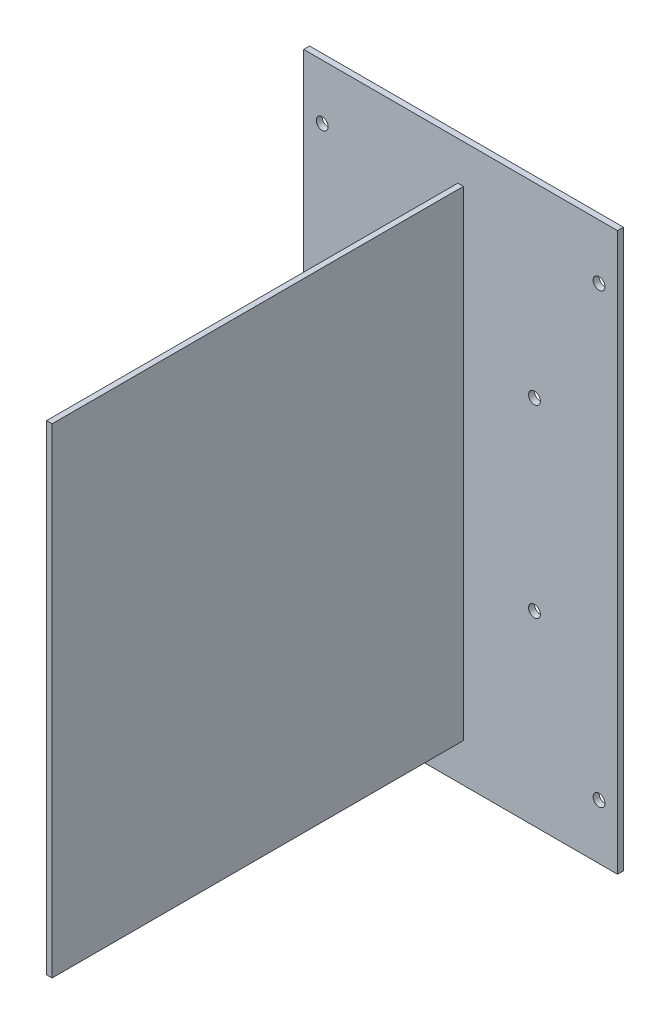
ISO-10303-21;
HEADER;
FILE_DESCRIPTION(('STEP AP214'),'2;1');
FILE_NAME('part.step','',(''),(''),'','','');
FILE_SCHEMA(('AUTOMOTIVE_DESIGN { 1 0 10303 214 1 1 1 1 }'));
ENDSEC;
DATA;
#1=APPLICATION_CONTEXT('core data for automotive mechanical design processes');
#2=APPLICATION_PROTOCOL_DEFINITION('international standard','automotive_design',2000,#1);
#3=PRODUCT_CONTEXT('',#1,'mechanical');
#4=PRODUCT('Part','Part','',(#3));
#5=PRODUCT_RELATED_PRODUCT_CATEGORY('part','',(#4));
#6=PRODUCT_DEFINITION_FORMATION('','',#4);
#7=PRODUCT_DEFINITION_CONTEXT('part definition',#1,'design');
#8=PRODUCT_DEFINITION('design','',#6,#7);
#9=PRODUCT_DEFINITION_SHAPE('','',#8);
#10=(LENGTH_UNIT() NAMED_UNIT(*) SI_UNIT(.MILLI.,.METRE.));
#11=(NAMED_UNIT(*) PLANE_ANGLE_UNIT() SI_UNIT($,.RADIAN.));
#12=(NAMED_UNIT(*) SI_UNIT($,.STERADIAN.) SOLID_ANGLE_UNIT());
#13=UNCERTAINTY_MEASURE_WITH_UNIT(LENGTH_MEASURE(1.E-05),#10,'distance_accuracy_value','');
#14=(GEOMETRIC_REPRESENTATION_CONTEXT(3) GLOBAL_UNCERTAINTY_ASSIGNED_CONTEXT((#13)) GLOBAL_UNIT_ASSIGNED_CONTEXT((#10,
#11,#12)) REPRESENTATION_CONTEXT('',''));
#15=CARTESIAN_POINT('',(0.,0.,0.));
#16=DIRECTION('',(0.,0.,1.));
#17=DIRECTION('',(1.,0.,0.));
#18=AXIS2_PLACEMENT_3D('',#15,#16,#17);
#19=CARTESIAN_POINT('',(-0.75,65.,113.));
#20=DIRECTION('',(-1.,0.,0.));
#21=DIRECTION('',(0.,0.,1.));
#22=AXIS2_PLACEMENT_3D('',#19,#20,#21);
#23=PLANE('',#22);
#24=DIRECTION('',(0.,1.,0.));
#25=VECTOR('',#24,1.);
#26=CARTESIAN_POINT('',(-0.75,65.,0.));
#27=LINE('',#26,#25);
#28=CARTESIAN_POINT('',(-0.75,-65.,0.));
#29=VERTEX_POINT('',#28);
#30=CARTESIAN_POINT('',(-0.75,65.,0.));
#31=VERTEX_POINT('',#30);
#32=EDGE_CURVE('E107',#29,#31,#27,.T.);
#33=ORIENTED_EDGE('',*,*,#32,.F.);
#34=DIRECTION('',(0.,0.,-1.));
#35=VECTOR('',#34,1.);
#36=CARTESIAN_POINT('',(-0.75,-65.,113.));
#37=LINE('',#36,#35);
#38=CARTESIAN_POINT('',(-0.75,-65.,113.));
#39=VERTEX_POINT('',#38);
#40=EDGE_CURVE('E12',#39,#29,#37,.T.);
#41=ORIENTED_EDGE('',*,*,#40,.F.);
#42=DIRECTION('',(0.,1.,0.));
#43=VECTOR('',#42,1.);
#44=CARTESIAN_POINT('',(-0.75,65.,113.));
#45=LINE('',#44,#43);
#46=CARTESIAN_POINT('',(-0.75,65.,113.));
#47=VERTEX_POINT('',#46);
#48=EDGE_CURVE('E101',#39,#47,#45,.T.);
#49=ORIENTED_EDGE('',*,*,#48,.T.);
#50=DIRECTION('',(0.,0.,-1.));
#51=VECTOR('',#50,1.);
#52=CARTESIAN_POINT('',(-0.75,65.,113.));
#53=LINE('',#52,#51);
#54=EDGE_CURVE('E46',#47,#31,#53,.T.);
#55=ORIENTED_EDGE('',*,*,#54,.T.);
#56=EDGE_LOOP('',(#33,#41,#49,#55));
#57=FACE_BOUND('',#56,.T.);
#58=ADVANCED_FACE('F43',(#57),#23,.T.);
#59=CARTESIAN_POINT('',(-0.75,-65.,113.));
#60=DIRECTION('',(0.,-1.,0.));
#61=DIRECTION('',(0.,0.,-1.));
#62=AXIS2_PLACEMENT_3D('',#59,#60,#61);
#63=PLANE('',#62);
#64=DIRECTION('',(-1.,0.,0.));
#65=VECTOR('',#64,1.);
#66=CARTESIAN_POINT('',(-0.75,-65.,0.));
#67=LINE('',#66,#65);
#68=CARTESIAN_POINT('',(0.75,-65.,0.));
#69=VERTEX_POINT('',#68);
#70=EDGE_CURVE('E103',#69,#29,#67,.T.);
#71=ORIENTED_EDGE('',*,*,#70,.F.);
#72=DIRECTION('',(0.,0.,-1.));
#73=VECTOR('',#72,1.);
#74=CARTESIAN_POINT('',(0.75,-65.,113.));
#75=LINE('',#74,#73);
#76=CARTESIAN_POINT('',(0.75,-65.,113.));
#77=VERTEX_POINT('',#76);
#78=EDGE_CURVE('E52',#77,#69,#75,.T.);
#79=ORIENTED_EDGE('',*,*,#78,.F.);
#80=DIRECTION('',(-1.,0.,0.));
#81=VECTOR('',#80,1.);
#82=CARTESIAN_POINT('',(-0.75,-65.,113.));
#83=LINE('',#82,#81);
#84=EDGE_CURVE('E98',#77,#39,#83,.T.);
#85=ORIENTED_EDGE('',*,*,#84,.T.);
#86=ORIENTED_EDGE('',*,*,#40,.T.);
#87=EDGE_LOOP('',(#71,#79,#85,#86));
#88=FACE_BOUND('',#87,.T.);
#89=ADVANCED_FACE('F117',(#88),#63,.T.);
#90=CARTESIAN_POINT('',(0.75,-65.,113.));
#91=DIRECTION('',(1.,0.,0.));
#92=DIRECTION('',(0.,1.,0.));
#93=AXIS2_PLACEMENT_3D('',#90,#91,#92);
#94=PLANE('',#93);
#95=DIRECTION('',(0.,-1.,0.));
#96=VECTOR('',#95,1.);
#97=CARTESIAN_POINT('',(0.75,-65.,0.));
#98=LINE('',#97,#96);
#99=CARTESIAN_POINT('',(0.75,65.,0.));
#100=VERTEX_POINT('',#99);
#101=EDGE_CURVE('E93',#100,#69,#98,.T.);
#102=ORIENTED_EDGE('',*,*,#101,.F.);
#103=DIRECTION('',(0.,0.,-1.));
#104=VECTOR('',#103,1.);
#105=CARTESIAN_POINT('',(0.75,65.,113.));
#106=LINE('',#105,#104);
#107=CARTESIAN_POINT('',(0.75,65.,113.));
#108=VERTEX_POINT('',#107);
#109=EDGE_CURVE('E88',#108,#100,#106,.T.);
#110=ORIENTED_EDGE('',*,*,#109,.F.);
#111=DIRECTION('',(0.,-1.,0.));
#112=VECTOR('',#111,1.);
#113=CARTESIAN_POINT('',(0.75,-65.,113.));
#114=LINE('',#113,#112);
#115=EDGE_CURVE('E91',#108,#77,#114,.T.);
#116=ORIENTED_EDGE('',*,*,#115,.T.);
#117=ORIENTED_EDGE('',*,*,#78,.T.);
#118=EDGE_LOOP('',(#102,#110,#116,#117));
#119=FACE_BOUND('',#118,.T.);
#120=ADVANCED_FACE('F90',(#119),#94,.T.);
#121=CARTESIAN_POINT('',(0.75,65.,113.));
#122=DIRECTION('',(0.,1.,0.));
#123=DIRECTION('',(0.,0.,1.));
#124=AXIS2_PLACEMENT_3D('',#121,#122,#123);
#125=PLANE('',#124);
#126=DIRECTION('',(1.,0.,0.));
#127=VECTOR('',#126,1.);
#128=CARTESIAN_POINT('',(0.75,65.,0.));
#129=LINE('',#128,#127);
#130=EDGE_CURVE('E110',#31,#100,#129,.T.);
#131=ORIENTED_EDGE('',*,*,#130,.F.);
#132=ORIENTED_EDGE('',*,*,#54,.F.);
#133=DIRECTION('',(1.,0.,0.));
#134=VECTOR('',#133,1.);
#135=CARTESIAN_POINT('',(0.75,65.,113.));
#136=LINE('',#135,#134);
#137=EDGE_CURVE('E97',#47,#108,#136,.T.);
#138=ORIENTED_EDGE('',*,*,#137,.T.);
#139=ORIENTED_EDGE('',*,*,#109,.T.);
#140=EDGE_LOOP('',(#131,#132,#138,#139));
#141=FACE_BOUND('',#140,.T.);
#142=ADVANCED_FACE('F100',(#141),#125,.T.);
#143=CARTESIAN_POINT('',(0.,0.,113.));
#144=DIRECTION('',(0.,0.,1.));
#145=DIRECTION('',(1.,0.,0.));
#146=AXIS2_PLACEMENT_3D('',#143,#144,#145);
#147=PLANE('',#146);
#148=ORIENTED_EDGE('',*,*,#48,.F.);
#149=ORIENTED_EDGE('',*,*,#84,.F.);
#150=ORIENTED_EDGE('',*,*,#115,.F.);
#151=ORIENTED_EDGE('',*,*,#137,.F.);
#152=EDGE_LOOP('',(#148,#149,#150,#151));
#153=FACE_BOUND('',#152,.T.);
#154=ADVANCED_FACE('F96',(#153),#147,.T.);
#155=CARTESIAN_POINT('',(0.,0.,0.));
#156=DIRECTION('',(0.,0.,1.));
#157=DIRECTION('',(1.,0.,0.));
#158=AXIS2_PLACEMENT_3D('',#155,#156,#157);
#159=PLANE('',#158);
#160=ORIENTED_EDGE('',*,*,#32,.T.);
#161=ORIENTED_EDGE('',*,*,#130,.T.);
#162=ORIENTED_EDGE('',*,*,#101,.T.);
#163=ORIENTED_EDGE('',*,*,#70,.T.);
#164=EDGE_LOOP('',(#160,#161,#162,#163));
#165=FACE_BOUND('',#164,.T.);
#166=ADVANCED_FACE('F116',(#165),#159,.F.);
#167=CLOSED_SHELL('',(#58,#89,#120,#142,#154,#166));
#168=MANIFOLD_SOLID_BREP('B2',#167);
#169=CARTESIAN_POINT('',(0.,0.,1.6));
#170=DIRECTION('',(0.,0.,-1.));
#171=DIRECTION('',(-1.,0.,0.));
#172=AXIS2_PLACEMENT_3D('',#169,#170,#171);
#173=PLANE('',#172);
#174=DIRECTION('',(1.,0.,0.));
#175=VECTOR('',#174,1.);
#176=CARTESIAN_POINT('',(0.75,-65.,1.6));
#177=LINE('',#176,#175);
#178=CARTESIAN_POINT('',(-0.75,-65.,1.6));
#179=VERTEX_POINT('',#178);
#180=CARTESIAN_POINT('',(0.75,-65.,1.6));
#181=VERTEX_POINT('',#180);
#182=EDGE_CURVE('E259',#179,#181,#177,.T.);
#183=ORIENTED_EDGE('',*,*,#182,.F.);
#184=DIRECTION('',(0.,-1.,0.));
#185=VECTOR('',#184,1.);
#186=CARTESIAN_POINT('',(-0.75,-65.,1.6));
#187=LINE('',#186,#185);
#188=CARTESIAN_POINT('',(-0.75,65.,1.6));
#189=VERTEX_POINT('',#188);
#190=EDGE_CURVE('E182',#189,#179,#187,.T.);
#191=ORIENTED_EDGE('',*,*,#190,.F.);
#192=DIRECTION('',(-1.,0.,0.));
#193=VECTOR('',#192,1.);
#194=CARTESIAN_POINT('',(0.75,65.,1.6));
#195=LINE('',#194,#193);
#196=CARTESIAN_POINT('',(0.75,65.,1.6));
#197=VERTEX_POINT('',#196);
#198=EDGE_CURVE('E250',#197,#189,#195,.T.);
#199=ORIENTED_EDGE('',*,*,#198,.F.);
#200=DIRECTION('',(0.,1.,0.));
#201=VECTOR('',#200,1.);
#202=CARTESIAN_POINT('',(0.75,-65.,1.6));
#203=LINE('',#202,#201);
#204=EDGE_CURVE('E253',#181,#197,#203,.T.);
#205=ORIENTED_EDGE('',*,*,#204,.F.);
#206=EDGE_LOOP('',(#183,#191,#199,#205));
#207=FACE_BOUND('',#206,.T.);
#208=DIRECTION('',(0.,-1.,0.));
#209=VECTOR('',#208,1.);
#210=CARTESIAN_POINT('',(-42.5,75.5,1.6));
#211=LINE('',#210,#209);
#212=CARTESIAN_POINT('',(-42.5,75.5,1.6));
#213=VERTEX_POINT('',#212);
#214=CARTESIAN_POINT('',(-42.5,-75.5,1.6));
#215=VERTEX_POINT('',#214);
#216=EDGE_CURVE('E317',#213,#215,#211,.T.);
#217=ORIENTED_EDGE('',*,*,#216,.T.);
#218=DIRECTION('',(1.,0.,0.));
#219=VECTOR('',#218,1.);
#220=CARTESIAN_POINT('',(42.5,-75.5,1.6));
#221=LINE('',#220,#219);
#222=CARTESIAN_POINT('',(42.5,-75.5,1.6));
#223=VERTEX_POINT('',#222);
#224=EDGE_CURVE('E320',#215,#223,#221,.T.);
#225=ORIENTED_EDGE('',*,*,#224,.T.);
#226=DIRECTION('',(0.,1.,0.));
#227=VECTOR('',#226,1.);
#228=CARTESIAN_POINT('',(42.5,75.5,1.6));
#229=LINE('',#228,#227);
#230=CARTESIAN_POINT('',(42.5,75.5,1.6));
#231=VERTEX_POINT('',#230);
#232=EDGE_CURVE('E323',#223,#231,#229,.T.);
#233=ORIENTED_EDGE('',*,*,#232,.T.);
#234=DIRECTION('',(-1.,0.,0.));
#235=VECTOR('',#234,1.);
#236=CARTESIAN_POINT('',(42.5,75.5,1.6));
#237=LINE('',#236,#235);
#238=EDGE_CURVE('E325',#231,#213,#237,.T.);
#239=ORIENTED_EDGE('',*,*,#238,.T.);
#240=EDGE_LOOP('',(#217,#225,#233,#239));
#241=FACE_BOUND('',#240,.T.);
#242=CARTESIAN_POINT('',(37.5,60.6,1.6));
#243=DIRECTION('',(0.,0.,1.));
#244=DIRECTION('',(1.,0.,0.));
#245=AXIS2_PLACEMENT_3D('',#242,#243,#244);
#246=CIRCLE('',#245,1.6);
#247=CARTESIAN_POINT('',(39.1,60.6,1.6));
#248=VERTEX_POINT('',#247);
#249=EDGE_CURVE('E311',#248,#248,#246,.T.);
#250=ORIENTED_EDGE('',*,*,#249,.F.);
#251=EDGE_LOOP('',(#250));
#252=FACE_BOUND('',#251,.T.);
#253=CARTESIAN_POINT('',(-37.5,60.6,1.6));
#254=DIRECTION('',(0.,0.,1.));
#255=DIRECTION('',(1.,0.,0.));
#256=AXIS2_PLACEMENT_3D('',#253,#254,#255);
#257=CIRCLE('',#256,1.6);
#258=CARTESIAN_POINT('',(-35.9,60.6,1.6));
#259=VERTEX_POINT('',#258);
#260=EDGE_CURVE('E305',#259,#259,#257,.T.);
#261=ORIENTED_EDGE('',*,*,#260,.F.);
#262=EDGE_LOOP('',(#261));
#263=FACE_BOUND('',#262,.T.);
#264=CARTESIAN_POINT('',(-37.5,-60.6,1.6));
#265=DIRECTION('',(0.,0.,1.));
#266=DIRECTION('',(1.,0.,0.));
#267=AXIS2_PLACEMENT_3D('',#264,#265,#266);
#268=CIRCLE('',#267,1.6);
#269=CARTESIAN_POINT('',(-35.9,-60.6,1.6));
#270=VERTEX_POINT('',#269);
#271=EDGE_CURVE('E299',#270,#270,#268,.T.);
#272=ORIENTED_EDGE('',*,*,#271,.F.);
#273=EDGE_LOOP('',(#272));
#274=FACE_BOUND('',#273,.T.);
#275=CARTESIAN_POINT('',(37.5,-60.6,1.6));
#276=DIRECTION('',(0.,0.,1.));
#277=DIRECTION('',(1.,0.,0.));
#278=AXIS2_PLACEMENT_3D('',#275,#276,#277);
#279=CIRCLE('',#278,1.6);
#280=CARTESIAN_POINT('',(39.1,-60.6,1.6));
#281=VERTEX_POINT('',#280);
#282=EDGE_CURVE('E293',#281,#281,#279,.T.);
#283=ORIENTED_EDGE('',*,*,#282,.F.);
#284=EDGE_LOOP('',(#283));
#285=FACE_BOUND('',#284,.T.);
#286=CARTESIAN_POINT('',(-20.,25.,1.6));
#287=DIRECTION('',(0.,0.,1.));
#288=DIRECTION('',(1.,0.,0.));
#289=AXIS2_PLACEMENT_3D('',#286,#287,#288);
#290=CIRCLE('',#289,1.6);
#291=CARTESIAN_POINT('',(-18.4,25.,1.6));
#292=VERTEX_POINT('',#291);
#293=EDGE_CURVE('E287',#292,#292,#290,.T.);
#294=ORIENTED_EDGE('',*,*,#293,.F.);
#295=EDGE_LOOP('',(#294));
#296=FACE_BOUND('',#295,.T.);
#297=CARTESIAN_POINT('',(20.,25.,1.6));
#298=DIRECTION('',(0.,0.,1.));
#299=DIRECTION('',(1.,0.,0.));
#300=AXIS2_PLACEMENT_3D('',#297,#298,#299);
#301=CIRCLE('',#300,1.6);
#302=CARTESIAN_POINT('',(21.6,25.,1.6));
#303=VERTEX_POINT('',#302);
#304=EDGE_CURVE('E281',#303,#303,#301,.T.);
#305=ORIENTED_EDGE('',*,*,#304,.F.);
#306=EDGE_LOOP('',(#305));
#307=FACE_BOUND('',#306,.T.);
#308=CARTESIAN_POINT('',(20.,-25.,1.6));
#309=DIRECTION('',(0.,0.,1.));
#310=DIRECTION('',(1.,0.,0.));
#311=AXIS2_PLACEMENT_3D('',#308,#309,#310);
#312=CIRCLE('',#311,1.6);
#313=CARTESIAN_POINT('',(21.6,-25.,1.6));
#314=VERTEX_POINT('',#313);
#315=EDGE_CURVE('E275',#314,#314,#312,.T.);
#316=ORIENTED_EDGE('',*,*,#315,.F.);
#317=EDGE_LOOP('',(#316));
#318=FACE_BOUND('',#317,.T.);
#319=CARTESIAN_POINT('',(-20.,-25.,1.6));
#320=DIRECTION('',(0.,0.,1.));
#321=DIRECTION('',(1.,0.,0.));
#322=AXIS2_PLACEMENT_3D('',#319,#320,#321);
#323=CIRCLE('',#322,1.6);
#324=CARTESIAN_POINT('',(-18.4,-25.,1.6));
#325=VERTEX_POINT('',#324);
#326=EDGE_CURVE('E269',#325,#325,#323,.T.);
#327=ORIENTED_EDGE('',*,*,#326,.F.);
#328=EDGE_LOOP('',(#327));
#329=FACE_BOUND('',#328,.T.);
#330=ADVANCED_FACE('F167',(#207,#241,#252,#263,#274,#285,#296,#307,#318,#329),#173,.F.);
#331=CARTESIAN_POINT('',(0.,0.,0.));
#332=DIRECTION('',(0.,0.,-1.));
#333=DIRECTION('',(-1.,0.,0.));
#334=AXIS2_PLACEMENT_3D('',#331,#332,#333);
#335=PLANE('',#334);
#336=DIRECTION('',(0.,-1.,0.));
#337=VECTOR('',#336,1.);
#338=CARTESIAN_POINT('',(-0.75,-65.,0.));
#339=LINE('',#338,#337);
#340=CARTESIAN_POINT('',(-0.75,65.,0.));
#341=VERTEX_POINT('',#340);
#342=CARTESIAN_POINT('',(-0.75,-65.,0.));
#343=VERTEX_POINT('',#342);
#344=EDGE_CURVE('E234',#341,#343,#339,.T.);
#345=ORIENTED_EDGE('',*,*,#344,.T.);
#346=DIRECTION('',(1.,0.,0.));
#347=VECTOR('',#346,1.);
#348=CARTESIAN_POINT('',(0.75,-65.,0.));
#349=LINE('',#348,#347);
#350=CARTESIAN_POINT('',(0.75,-65.,0.));
#351=VERTEX_POINT('',#350);
#352=EDGE_CURVE('E243',#343,#351,#349,.T.);
#353=ORIENTED_EDGE('',*,*,#352,.T.);
#354=DIRECTION('',(0.,1.,0.));
#355=VECTOR('',#354,1.);
#356=CARTESIAN_POINT('',(0.75,-65.,0.));
#357=LINE('',#356,#355);
#358=CARTESIAN_POINT('',(0.75,65.,0.));
#359=VERTEX_POINT('',#358);
#360=EDGE_CURVE('E190',#351,#359,#357,.T.);
#361=ORIENTED_EDGE('',*,*,#360,.T.);
#362=DIRECTION('',(-1.,0.,0.));
#363=VECTOR('',#362,1.);
#364=CARTESIAN_POINT('',(0.75,65.,0.));
#365=LINE('',#364,#363);
#366=EDGE_CURVE('E240',#359,#341,#365,.T.);
#367=ORIENTED_EDGE('',*,*,#366,.T.);
#368=EDGE_LOOP('',(#345,#353,#361,#367));
#369=FACE_BOUND('',#368,.T.);
#370=CARTESIAN_POINT('',(20.,-25.,0.));
#371=DIRECTION('',(0.,0.,1.));
#372=DIRECTION('',(1.,0.,0.));
#373=AXIS2_PLACEMENT_3D('',#370,#371,#372);
#374=CIRCLE('',#373,1.6);
#375=CARTESIAN_POINT('',(21.6,-25.,0.));
#376=VERTEX_POINT('',#375);
#377=EDGE_CURVE('E272',#376,#376,#374,.T.);
#378=ORIENTED_EDGE('',*,*,#377,.T.);
#379=EDGE_LOOP('',(#378));
#380=FACE_BOUND('',#379,.T.);
#381=CARTESIAN_POINT('',(-20.,25.,0.));
#382=DIRECTION('',(0.,0.,1.));
#383=DIRECTION('',(1.,0.,0.));
#384=AXIS2_PLACEMENT_3D('',#381,#382,#383);
#385=CIRCLE('',#384,1.6);
#386=CARTESIAN_POINT('',(-18.4,25.,0.));
#387=VERTEX_POINT('',#386);
#388=EDGE_CURVE('E284',#387,#387,#385,.T.);
#389=ORIENTED_EDGE('',*,*,#388,.T.);
#390=EDGE_LOOP('',(#389));
#391=FACE_BOUND('',#390,.T.);
#392=CARTESIAN_POINT('',(-37.5,-60.6,0.));
#393=DIRECTION('',(0.,0.,1.));
#394=DIRECTION('',(1.,0.,0.));
#395=AXIS2_PLACEMENT_3D('',#392,#393,#394);
#396=CIRCLE('',#395,1.6);
#397=CARTESIAN_POINT('',(-35.9,-60.6,0.));
#398=VERTEX_POINT('',#397);
#399=EDGE_CURVE('E296',#398,#398,#396,.T.);
#400=ORIENTED_EDGE('',*,*,#399,.T.);
#401=EDGE_LOOP('',(#400));
#402=FACE_BOUND('',#401,.T.);
#403=CARTESIAN_POINT('',(37.5,60.6,0.));
#404=DIRECTION('',(0.,0.,1.));
#405=DIRECTION('',(1.,0.,0.));
#406=AXIS2_PLACEMENT_3D('',#403,#404,#405);
#407=CIRCLE('',#406,1.6);
#408=CARTESIAN_POINT('',(39.1,60.6,0.));
#409=VERTEX_POINT('',#408);
#410=EDGE_CURVE('E308',#409,#409,#407,.T.);
#411=ORIENTED_EDGE('',*,*,#410,.T.);
#412=EDGE_LOOP('',(#411));
#413=FACE_BOUND('',#412,.T.);
#414=DIRECTION('',(0.,-1.,0.));
#415=VECTOR('',#414,1.);
#416=CARTESIAN_POINT('',(-42.5,75.5,0.));
#417=LINE('',#416,#415);
#418=CARTESIAN_POINT('',(-42.5,75.5,0.));
#419=VERTEX_POINT('',#418);
#420=CARTESIAN_POINT('',(-42.5,-75.5,0.));
#421=VERTEX_POINT('',#420);
#422=EDGE_CURVE('E314',#419,#421,#417,.T.);
#423=ORIENTED_EDGE('',*,*,#422,.F.);
#424=DIRECTION('',(-1.,0.,0.));
#425=VECTOR('',#424,1.);
#426=CARTESIAN_POINT('',(42.5,75.5,0.));
#427=LINE('',#426,#425);
#428=CARTESIAN_POINT('',(42.5,75.5,0.));
#429=VERTEX_POINT('',#428);
#430=EDGE_CURVE('E321',#429,#419,#427,.T.);
#431=ORIENTED_EDGE('',*,*,#430,.F.);
#432=DIRECTION('',(0.,1.,0.));
#433=VECTOR('',#432,1.);
#434=CARTESIAN_POINT('',(42.5,75.5,0.));
#435=LINE('',#434,#433);
#436=CARTESIAN_POINT('',(42.5,-75.5,0.));
#437=VERTEX_POINT('',#436);
#438=EDGE_CURVE('E332',#437,#429,#435,.T.);
#439=ORIENTED_EDGE('',*,*,#438,.F.);
#440=DIRECTION('',(1.,0.,0.));
#441=VECTOR('',#440,1.);
#442=CARTESIAN_POINT('',(42.5,-75.5,0.));
#443=LINE('',#442,#441);
#444=EDGE_CURVE('E330',#421,#437,#443,.T.);
#445=ORIENTED_EDGE('',*,*,#444,.F.);
#446=EDGE_LOOP('',(#423,#431,#439,#445));
#447=FACE_BOUND('',#446,.T.);
#448=CARTESIAN_POINT('',(-37.5,60.6,0.));
#449=DIRECTION('',(0.,0.,1.));
#450=DIRECTION('',(1.,0.,0.));
#451=AXIS2_PLACEMENT_3D('',#448,#449,#450);
#452=CIRCLE('',#451,1.6);
#453=CARTESIAN_POINT('',(-35.9,60.6,0.));
#454=VERTEX_POINT('',#453);
#455=EDGE_CURVE('E302',#454,#454,#452,.T.);
#456=ORIENTED_EDGE('',*,*,#455,.T.);
#457=EDGE_LOOP('',(#456));
#458=FACE_BOUND('',#457,.T.);
#459=CARTESIAN_POINT('',(37.5,-60.6,0.));
#460=DIRECTION('',(0.,0.,1.));
#461=DIRECTION('',(1.,0.,0.));
#462=AXIS2_PLACEMENT_3D('',#459,#460,#461);
#463=CIRCLE('',#462,1.6);
#464=CARTESIAN_POINT('',(39.1,-60.6,0.));
#465=VERTEX_POINT('',#464);
#466=EDGE_CURVE('E290',#465,#465,#463,.T.);
#467=ORIENTED_EDGE('',*,*,#466,.T.);
#468=EDGE_LOOP('',(#467));
#469=FACE_BOUND('',#468,.T.);
#470=CARTESIAN_POINT('',(20.,25.,0.));
#471=DIRECTION('',(0.,0.,1.));
#472=DIRECTION('',(1.,0.,0.));
#473=AXIS2_PLACEMENT_3D('',#470,#471,#472);
#474=CIRCLE('',#473,1.6);
#475=CARTESIAN_POINT('',(21.6,25.,0.));
#476=VERTEX_POINT('',#475);
#477=EDGE_CURVE('E278',#476,#476,#474,.T.);
#478=ORIENTED_EDGE('',*,*,#477,.T.);
#479=EDGE_LOOP('',(#478));
#480=FACE_BOUND('',#479,.T.);
#481=CARTESIAN_POINT('',(-20.,-25.,0.));
#482=DIRECTION('',(0.,0.,1.));
#483=DIRECTION('',(1.,0.,0.));
#484=AXIS2_PLACEMENT_3D('',#481,#482,#483);
#485=CIRCLE('',#484,1.6);
#486=CARTESIAN_POINT('',(-18.4,-25.,0.));
#487=VERTEX_POINT('',#486);
#488=EDGE_CURVE('E265',#487,#487,#485,.T.);
#489=ORIENTED_EDGE('',*,*,#488,.T.);
#490=EDGE_LOOP('',(#489));
#491=FACE_BOUND('',#490,.T.);
#492=ADVANCED_FACE('F247',(#369,#380,#391,#402,#413,#447,#458,#469,#480,#491),#335,.T.);
#493=CARTESIAN_POINT('',(-42.5,75.5,1.6));
#494=DIRECTION('',(1.,0.,0.));
#495=DIRECTION('',(0.,1.,0.));
#496=AXIS2_PLACEMENT_3D('',#493,#494,#495);
#497=PLANE('',#496);
#498=ORIENTED_EDGE('',*,*,#422,.T.);
#499=DIRECTION('',(0.,0.,-1.));
#500=VECTOR('',#499,1.);
#501=CARTESIAN_POINT('',(-42.5,-75.5,1.6));
#502=LINE('',#501,#500);
#503=EDGE_CURVE('E41',#215,#421,#502,.T.);
#504=ORIENTED_EDGE('',*,*,#503,.F.);
#505=ORIENTED_EDGE('',*,*,#216,.F.);
#506=DIRECTION('',(0.,0.,-1.));
#507=VECTOR('',#506,1.);
#508=CARTESIAN_POINT('',(-42.5,75.5,1.6));
#509=LINE('',#508,#507);
#510=EDGE_CURVE('E327',#213,#419,#509,.T.);
#511=ORIENTED_EDGE('',*,*,#510,.T.);
#512=EDGE_LOOP('',(#498,#504,#505,#511));
#513=FACE_BOUND('',#512,.T.);
#514=ADVANCED_FACE('F169',(#513),#497,.F.);
#515=CARTESIAN_POINT('',(42.5,-75.5,1.6));
#516=DIRECTION('',(0.,1.,0.));
#517=DIRECTION('',(-1.,0.,0.));
#518=AXIS2_PLACEMENT_3D('',#515,#516,#517);
#519=PLANE('',#518);
#520=ORIENTED_EDGE('',*,*,#444,.T.);
#521=DIRECTION('',(0.,0.,-1.));
#522=VECTOR('',#521,1.);
#523=CARTESIAN_POINT('',(42.5,-75.5,1.6));
#524=LINE('',#523,#522);
#525=EDGE_CURVE('E175',#223,#437,#524,.T.);
#526=ORIENTED_EDGE('',*,*,#525,.F.);
#527=ORIENTED_EDGE('',*,*,#224,.F.);
#528=ORIENTED_EDGE('',*,*,#503,.T.);
#529=EDGE_LOOP('',(#520,#526,#527,#528));
#530=FACE_BOUND('',#529,.T.);
#531=ADVANCED_FACE('F360',(#530),#519,.F.);
#532=CARTESIAN_POINT('',(42.5,75.5,1.6));
#533=DIRECTION('',(-1.,0.,0.));
#534=DIRECTION('',(0.,-1.,0.));
#535=AXIS2_PLACEMENT_3D('',#532,#533,#534);
#536=PLANE('',#535);
#537=ORIENTED_EDGE('',*,*,#438,.T.);
#538=DIRECTION('',(0.,0.,-1.));
#539=VECTOR('',#538,1.);
#540=CARTESIAN_POINT('',(42.5,75.5,1.6));
#541=LINE('',#540,#539);
#542=EDGE_CURVE('E337',#231,#429,#541,.T.);
#543=ORIENTED_EDGE('',*,*,#542,.F.);
#544=ORIENTED_EDGE('',*,*,#232,.F.);
#545=ORIENTED_EDGE('',*,*,#525,.T.);
#546=EDGE_LOOP('',(#537,#543,#544,#545));
#547=FACE_BOUND('',#546,.T.);
#548=ADVANCED_FACE('F344',(#547),#536,.F.);
#549=CARTESIAN_POINT('',(42.5,75.5,1.6));
#550=DIRECTION('',(0.,-1.,0.));
#551=DIRECTION('',(0.,0.,-1.));
#552=AXIS2_PLACEMENT_3D('',#549,#550,#551);
#553=PLANE('',#552);
#554=ORIENTED_EDGE('',*,*,#430,.T.);
#555=ORIENTED_EDGE('',*,*,#510,.F.);
#556=ORIENTED_EDGE('',*,*,#238,.F.);
#557=ORIENTED_EDGE('',*,*,#542,.T.);
#558=EDGE_LOOP('',(#554,#555,#556,#557));
#559=FACE_BOUND('',#558,.T.);
#560=ADVANCED_FACE('F353',(#559),#553,.F.);
#561=CARTESIAN_POINT('',(37.5,60.6,1.6));
#562=DIRECTION('',(0.,0.,-1.));
#563=DIRECTION('',(-1.,0.,0.));
#564=AXIS2_PLACEMENT_3D('',#561,#562,#563);
#565=CYLINDRICAL_SURFACE('',#564,1.6);
#566=ORIENTED_EDGE('',*,*,#249,.T.);
#567=EDGE_LOOP('',(#566));
#568=FACE_BOUND('',#567,.T.);
#569=ORIENTED_EDGE('',*,*,#410,.F.);
#570=EDGE_LOOP('',(#569));
#571=FACE_BOUND('',#570,.T.);
#572=ADVANCED_FACE('F375',(#568,#571),#565,.F.);
#573=CARTESIAN_POINT('',(-37.5,60.6,1.6));
#574=DIRECTION('',(0.,0.,-1.));
#575=DIRECTION('',(-1.,0.,0.));
#576=AXIS2_PLACEMENT_3D('',#573,#574,#575);
#577=CYLINDRICAL_SURFACE('',#576,1.6);
#578=ORIENTED_EDGE('',*,*,#260,.T.);
#579=EDGE_LOOP('',(#578));
#580=FACE_BOUND('',#579,.T.);
#581=ORIENTED_EDGE('',*,*,#455,.F.);
#582=EDGE_LOOP('',(#581));
#583=FACE_BOUND('',#582,.T.);
#584=ADVANCED_FACE('F382',(#580,#583),#577,.F.);
#585=CARTESIAN_POINT('',(-37.5,-60.6,1.6));
#586=DIRECTION('',(0.,0.,-1.));
#587=DIRECTION('',(-1.,0.,0.));
#588=AXIS2_PLACEMENT_3D('',#585,#586,#587);
#589=CYLINDRICAL_SURFACE('',#588,1.6);
#590=ORIENTED_EDGE('',*,*,#271,.T.);
#591=EDGE_LOOP('',(#590));
#592=FACE_BOUND('',#591,.T.);
#593=ORIENTED_EDGE('',*,*,#399,.F.);
#594=EDGE_LOOP('',(#593));
#595=FACE_BOUND('',#594,.T.);
#596=ADVANCED_FACE('F387',(#592,#595),#589,.F.);
#597=CARTESIAN_POINT('',(37.5,-60.6,1.6));
#598=DIRECTION('',(0.,0.,-1.));
#599=DIRECTION('',(-1.,0.,0.));
#600=AXIS2_PLACEMENT_3D('',#597,#598,#599);
#601=CYLINDRICAL_SURFACE('',#600,1.6);
#602=ORIENTED_EDGE('',*,*,#282,.T.);
#603=EDGE_LOOP('',(#602));
#604=FACE_BOUND('',#603,.T.);
#605=ORIENTED_EDGE('',*,*,#466,.F.);
#606=EDGE_LOOP('',(#605));
#607=FACE_BOUND('',#606,.T.);
#608=ADVANCED_FACE('F432',(#604,#607),#601,.F.);
#609=CARTESIAN_POINT('',(-20.,25.,1.6));
#610=DIRECTION('',(0.,0.,-1.));
#611=DIRECTION('',(-1.,0.,0.));
#612=AXIS2_PLACEMENT_3D('',#609,#610,#611);
#613=CYLINDRICAL_SURFACE('',#612,1.6);
#614=ORIENTED_EDGE('',*,*,#293,.T.);
#615=EDGE_LOOP('',(#614));
#616=FACE_BOUND('',#615,.T.);
#617=ORIENTED_EDGE('',*,*,#388,.F.);
#618=EDGE_LOOP('',(#617));
#619=FACE_BOUND('',#618,.T.);
#620=ADVANCED_FACE('F428',(#616,#619),#613,.F.);
#621=CARTESIAN_POINT('',(20.,25.,1.6));
#622=DIRECTION('',(0.,0.,-1.));
#623=DIRECTION('',(-1.,0.,0.));
#624=AXIS2_PLACEMENT_3D('',#621,#622,#623);
#625=CYLINDRICAL_SURFACE('',#624,1.6);
#626=ORIENTED_EDGE('',*,*,#304,.T.);
#627=EDGE_LOOP('',(#626));
#628=FACE_BOUND('',#627,.T.);
#629=ORIENTED_EDGE('',*,*,#477,.F.);
#630=EDGE_LOOP('',(#629));
#631=FACE_BOUND('',#630,.T.);
#632=ADVANCED_FACE('F421',(#628,#631),#625,.F.);
#633=CARTESIAN_POINT('',(20.,-25.,1.6));
#634=DIRECTION('',(0.,0.,-1.));
#635=DIRECTION('',(-1.,0.,0.));
#636=AXIS2_PLACEMENT_3D('',#633,#634,#635);
#637=CYLINDRICAL_SURFACE('',#636,1.6);
#638=ORIENTED_EDGE('',*,*,#315,.T.);
#639=EDGE_LOOP('',(#638));
#640=FACE_BOUND('',#639,.T.);
#641=ORIENTED_EDGE('',*,*,#377,.F.);
#642=EDGE_LOOP('',(#641));
#643=FACE_BOUND('',#642,.T.);
#644=ADVANCED_FACE('F411',(#640,#643),#637,.F.);
#645=CARTESIAN_POINT('',(-20.,-25.,1.6));
#646=DIRECTION('',(0.,0.,-1.));
#647=DIRECTION('',(-1.,0.,0.));
#648=AXIS2_PLACEMENT_3D('',#645,#646,#647);
#649=CYLINDRICAL_SURFACE('',#648,1.6);
#650=ORIENTED_EDGE('',*,*,#326,.T.);
#651=EDGE_LOOP('',(#650));
#652=FACE_BOUND('',#651,.T.);
#653=ORIENTED_EDGE('',*,*,#488,.F.);
#654=EDGE_LOOP('',(#653));
#655=FACE_BOUND('',#654,.T.);
#656=ADVANCED_FACE('F408',(#652,#655),#649,.F.);
#657=CARTESIAN_POINT('',(-0.75,-65.,0.));
#658=DIRECTION('',(-1.,0.,0.));
#659=DIRECTION('',(0.,0.,1.));
#660=AXIS2_PLACEMENT_3D('',#657,#658,#659);
#661=PLANE('',#660);
#662=ORIENTED_EDGE('',*,*,#190,.T.);
#663=DIRECTION('',(0.,0.,1.));
#664=VECTOR('',#663,1.);
#665=CARTESIAN_POINT('',(-0.75,-65.,0.));
#666=LINE('',#665,#664);
#667=EDGE_CURVE('E230',#343,#179,#666,.T.);
#668=ORIENTED_EDGE('',*,*,#667,.F.);
#669=ORIENTED_EDGE('',*,*,#344,.F.);
#670=DIRECTION('',(0.,0.,1.));
#671=VECTOR('',#670,1.);
#672=CARTESIAN_POINT('',(-0.75,65.,0.));
#673=LINE('',#672,#671);
#674=EDGE_CURVE('E263',#341,#189,#673,.T.);
#675=ORIENTED_EDGE('',*,*,#674,.T.);
#676=EDGE_LOOP('',(#662,#668,#669,#675));
#677=FACE_BOUND('',#676,.T.);
#678=ADVANCED_FACE('F232',(#677),#661,.F.);
#679=CARTESIAN_POINT('',(0.75,65.,0.));
#680=DIRECTION('',(0.,1.,0.));
#681=DIRECTION('',(0.,0.,1.));
#682=AXIS2_PLACEMENT_3D('',#679,#680,#681);
#683=PLANE('',#682);
#684=ORIENTED_EDGE('',*,*,#198,.T.);
#685=ORIENTED_EDGE('',*,*,#674,.F.);
#686=ORIENTED_EDGE('',*,*,#366,.F.);
#687=DIRECTION('',(0.,0.,1.));
#688=VECTOR('',#687,1.);
#689=CARTESIAN_POINT('',(0.75,65.,0.));
#690=LINE('',#689,#688);
#691=EDGE_CURVE('E266',#359,#197,#690,.T.);
#692=ORIENTED_EDGE('',*,*,#691,.T.);
#693=EDGE_LOOP('',(#684,#685,#686,#692));
#694=FACE_BOUND('',#693,.T.);
#695=ADVANCED_FACE('F419',(#694),#683,.F.);
#696=CARTESIAN_POINT('',(0.75,-65.,0.));
#697=DIRECTION('',(1.,0.,0.));
#698=DIRECTION('',(0.,1.,0.));
#699=AXIS2_PLACEMENT_3D('',#696,#697,#698);
#700=PLANE('',#699);
#701=ORIENTED_EDGE('',*,*,#204,.T.);
#702=ORIENTED_EDGE('',*,*,#691,.F.);
#703=ORIENTED_EDGE('',*,*,#360,.F.);
#704=DIRECTION('',(0.,0.,1.));
#705=VECTOR('',#704,1.);
#706=CARTESIAN_POINT('',(0.75,-65.,0.));
#707=LINE('',#706,#705);
#708=EDGE_CURVE('E239',#351,#181,#707,.T.);
#709=ORIENTED_EDGE('',*,*,#708,.T.);
#710=EDGE_LOOP('',(#701,#702,#703,#709));
#711=FACE_BOUND('',#710,.T.);
#712=ADVANCED_FACE('F492',(#711),#700,.F.);
#713=CARTESIAN_POINT('',(0.75,-65.,0.));
#714=DIRECTION('',(0.,-1.,0.));
#715=DIRECTION('',(0.,0.,-1.));
#716=AXIS2_PLACEMENT_3D('',#713,#714,#715);
#717=PLANE('',#716);
#718=ORIENTED_EDGE('',*,*,#182,.T.);
#719=ORIENTED_EDGE('',*,*,#708,.F.);
#720=ORIENTED_EDGE('',*,*,#352,.F.);
#721=ORIENTED_EDGE('',*,*,#667,.T.);
#722=EDGE_LOOP('',(#718,#719,#720,#721));
#723=FACE_BOUND('',#722,.T.);
#724=ADVANCED_FACE('F244',(#723),#717,.F.);
#725=CLOSED_SHELL('',(#330,#492,#514,#531,#548,#560,#572,#584,#596,#608,#620,#632,#644,#656,
#678,#695,#712,#724));
#726=MANIFOLD_SOLID_BREP('B6',#725);
#727=ADVANCED_BREP_SHAPE_REPRESENTATION('',(#18,#168,#726),#14);
#728=SHAPE_DEFINITION_REPRESENTATION(#9,#727);
ENDSEC;
END-ISO-10303-21;
